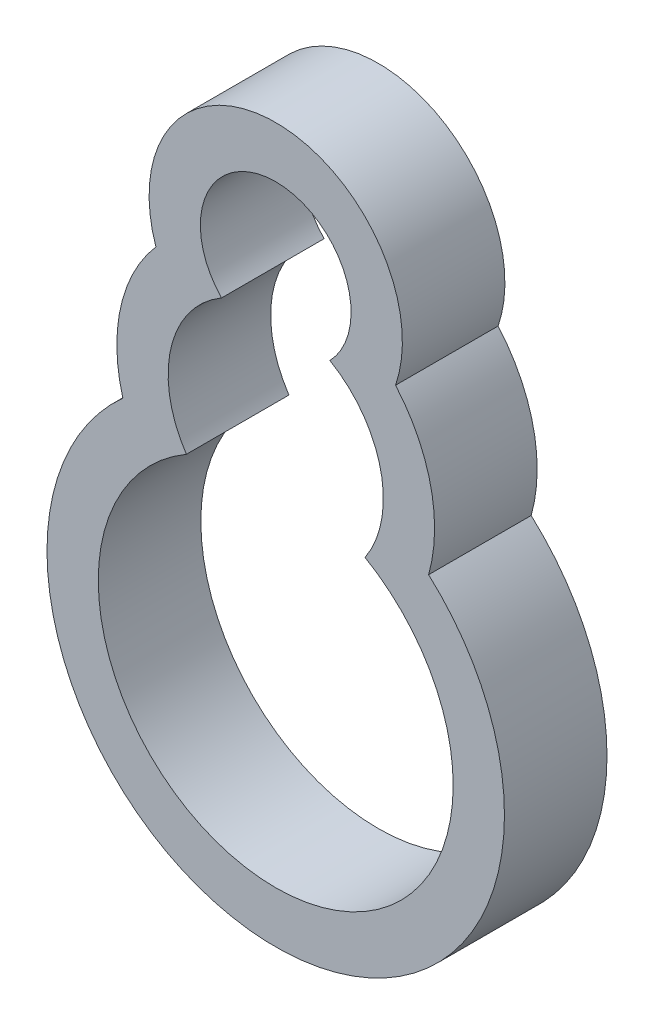
ISO-10303-21;
HEADER;
FILE_DESCRIPTION(('STEP AP214'),'2;1');
FILE_NAME('part.step','',(''),(''),'','','');
FILE_SCHEMA(('AUTOMOTIVE_DESIGN { 1 0 10303 214 1 1 1 1 }'));
ENDSEC;
DATA;
#1=APPLICATION_CONTEXT('core data for automotive mechanical design processes');
#2=APPLICATION_PROTOCOL_DEFINITION('international standard','automotive_design',2000,#1);
#3=PRODUCT_CONTEXT('',#1,'mechanical');
#4=PRODUCT('Part','Part','',(#3));
#5=PRODUCT_RELATED_PRODUCT_CATEGORY('part','',(#4));
#6=PRODUCT_DEFINITION_FORMATION('','',#4);
#7=PRODUCT_DEFINITION_CONTEXT('part definition',#1,'design');
#8=PRODUCT_DEFINITION('design','',#6,#7);
#9=PRODUCT_DEFINITION_SHAPE('','',#8);
#10=(LENGTH_UNIT() NAMED_UNIT(*) SI_UNIT(.MILLI.,.METRE.));
#11=(NAMED_UNIT(*) PLANE_ANGLE_UNIT() SI_UNIT($,.RADIAN.));
#12=(NAMED_UNIT(*) SI_UNIT($,.STERADIAN.) SOLID_ANGLE_UNIT());
#13=UNCERTAINTY_MEASURE_WITH_UNIT(LENGTH_MEASURE(1.E-05),#10,'distance_accuracy_value','');
#14=(GEOMETRIC_REPRESENTATION_CONTEXT(3) GLOBAL_UNCERTAINTY_ASSIGNED_CONTEXT((#13)) GLOBAL_UNIT_ASSIGNED_CONTEXT((#10,
#11,#12)) REPRESENTATION_CONTEXT('',''));
#15=CARTESIAN_POINT('',(0.,0.,0.));
#16=DIRECTION('',(0.,0.,1.));
#17=DIRECTION('',(1.,0.,0.));
#18=AXIS2_PLACEMENT_3D('',#15,#16,#17);
#19=CARTESIAN_POINT('',(0.,16.1078463236737,10.));
#20=DIRECTION('',(0.,0.,1.));
#21=DIRECTION('',(1.,0.,0.));
#22=AXIS2_PLACEMENT_3D('',#19,#20,#21);
#23=PLANE('',#22);
#24=CARTESIAN_POINT('',(0.,9.02039394125725,10.));
#25=DIRECTION('',(0.,0.,1.));
#26=DIRECTION('',(1.,0.,0.));
#27=AXIS2_PLACEMENT_3D('',#24,#25,#26);
#28=CIRCLE('',#27,15.4931113194217);
#29=CARTESIAN_POINT('',(14.9093042116603,4.80742037379208,10.));
#30=VERTEX_POINT('',#29);
#31=CARTESIAN_POINT('',(11.6839303061137,19.1949834149349,10.));
#32=VERTEX_POINT('',#31);
#33=EDGE_CURVE('E138',#30,#32,#28,.T.);
#34=ORIENTED_EDGE('',*,*,#33,.T.);
#35=CARTESIAN_POINT('',(0.,23.1952987060901,10.));
#36=DIRECTION('',(0.,0.,1.));
#37=DIRECTION('',(1.,0.,0.));
#38=AXIS2_PLACEMENT_3D('',#35,#36,#37);
#39=CIRCLE('',#38,12.3497671972702);
#40=CARTESIAN_POINT('',(-11.6839303061137,19.1949834149349,10.));
#41=VERTEX_POINT('',#40);
#42=EDGE_CURVE('E141',#32,#41,#39,.T.);
#43=ORIENTED_EDGE('',*,*,#42,.T.);
#44=CARTESIAN_POINT('',(0.,9.02039394125725,10.));
#45=DIRECTION('',(0.,0.,1.));
#46=DIRECTION('',(1.,0.,0.));
#47=AXIS2_PLACEMENT_3D('',#44,#45,#46);
#48=CIRCLE('',#47,15.4931113194217);
#49=CARTESIAN_POINT('',(-14.9093042116603,4.80742037379207,10.));
#50=VERTEX_POINT('',#49);
#51=EDGE_CURVE('E144',#41,#50,#48,.T.);
#52=ORIENTED_EDGE('',*,*,#51,.T.);
#53=CARTESIAN_POINT('',(0.,-11.7817390253156,10.));
#54=DIRECTION('',(0.,0.,1.));
#55=DIRECTION('',(1.,0.,0.));
#56=AXIS2_PLACEMENT_3D('',#53,#54,#55);
#57=CIRCLE('',#56,22.3044291934323);
#58=EDGE_CURVE('E146',#50,#30,#57,.T.);
#59=ORIENTED_EDGE('',*,*,#58,.T.);
#60=EDGE_LOOP('',(#34,#43,#52,#59));
#61=FACE_BOUND('',#60,.T.);
#62=CARTESIAN_POINT('',(0.,23.1952987060901,10.));
#63=DIRECTION('',(0.,0.,1.));
#64=DIRECTION('',(1.,0.,0.));
#65=AXIS2_PLACEMENT_3D('',#62,#63,#64);
#66=CIRCLE('',#65,7.34976719727021);
#67=CARTESIAN_POINT('',(5.28358941293976,18.086212606841,10.));
#68=VERTEX_POINT('',#67);
#69=CARTESIAN_POINT('',(-5.28358941293976,18.086212606841,10.));
#70=VERTEX_POINT('',#69);
#71=EDGE_CURVE('E110',#68,#70,#66,.T.);
#72=ORIENTED_EDGE('',*,*,#71,.F.);
#73=CARTESIAN_POINT('',(0.,9.02039394125725,10.));
#74=DIRECTION('',(0.,0.,1.));
#75=DIRECTION('',(1.,0.,0.));
#76=AXIS2_PLACEMENT_3D('',#73,#74,#75);
#77=CIRCLE('',#76,10.4931113194217);
#78=CARTESIAN_POINT('',(8.71098313313225,3.17025223219915,10.));
#79=VERTEX_POINT('',#78);
#80=EDGE_CURVE('E102',#79,#68,#77,.T.);
#81=ORIENTED_EDGE('',*,*,#80,.F.);
#82=CARTESIAN_POINT('',(0.,-11.7817390253156,10.));
#83=DIRECTION('',(0.,0.,1.));
#84=DIRECTION('',(1.,0.,0.));
#85=AXIS2_PLACEMENT_3D('',#82,#83,#84);
#86=CIRCLE('',#85,17.3044291934323);
#87=CARTESIAN_POINT('',(-8.71098313313225,3.17025223219915,10.));
#88=VERTEX_POINT('',#87);
#89=EDGE_CURVE('E124',#88,#79,#86,.T.);
#90=ORIENTED_EDGE('',*,*,#89,.F.);
#91=CARTESIAN_POINT('',(0.,9.02039394125725,10.));
#92=DIRECTION('',(0.,0.,1.));
#93=DIRECTION('',(1.,0.,0.));
#94=AXIS2_PLACEMENT_3D('',#91,#92,#93);
#95=CIRCLE('',#94,10.4931113194217);
#96=EDGE_CURVE('E122',#70,#88,#95,.T.);
#97=ORIENTED_EDGE('',*,*,#96,.F.);
#98=EDGE_LOOP('',(#72,#81,#90,#97));
#99=FACE_BOUND('',#98,.T.);
#100=ADVANCED_FACE('F37',(#61,#99),#23,.T.);
#101=CARTESIAN_POINT('',(0.,16.1078463236737,0.));
#102=DIRECTION('',(0.,0.,1.));
#103=DIRECTION('',(1.,0.,0.));
#104=AXIS2_PLACEMENT_3D('',#101,#102,#103);
#105=PLANE('',#104);
#106=CARTESIAN_POINT('',(0.,9.02039394125725,0.));
#107=DIRECTION('',(0.,0.,1.));
#108=DIRECTION('',(1.,0.,0.));
#109=AXIS2_PLACEMENT_3D('',#106,#107,#108);
#110=CIRCLE('',#109,15.4931113194217);
#111=CARTESIAN_POINT('',(14.9093042116603,4.80742037379208,0.));
#112=VERTEX_POINT('',#111);
#113=CARTESIAN_POINT('',(11.6839303061137,19.1949834149349,0.));
#114=VERTEX_POINT('',#113);
#115=EDGE_CURVE('E118',#112,#114,#110,.T.);
#116=ORIENTED_EDGE('',*,*,#115,.F.);
#117=CARTESIAN_POINT('',(0.,-11.7817390253156,0.));
#118=DIRECTION('',(0.,0.,1.));
#119=DIRECTION('',(1.,0.,0.));
#120=AXIS2_PLACEMENT_3D('',#117,#118,#119);
#121=CIRCLE('',#120,22.3044291934323);
#122=CARTESIAN_POINT('',(-14.9093042116603,4.80742037379207,0.));
#123=VERTEX_POINT('',#122);
#124=EDGE_CURVE('E142',#123,#112,#121,.T.);
#125=ORIENTED_EDGE('',*,*,#124,.F.);
#126=CARTESIAN_POINT('',(0.,9.02039394125725,0.));
#127=DIRECTION('',(0.,0.,1.));
#128=DIRECTION('',(1.,0.,0.));
#129=AXIS2_PLACEMENT_3D('',#126,#127,#128);
#130=CIRCLE('',#129,15.4931113194217);
#131=CARTESIAN_POINT('',(-11.6839303061137,19.1949834149349,0.));
#132=VERTEX_POINT('',#131);
#133=EDGE_CURVE('E153',#132,#123,#130,.T.);
#134=ORIENTED_EDGE('',*,*,#133,.F.);
#135=CARTESIAN_POINT('',(0.,23.1952987060901,0.));
#136=DIRECTION('',(0.,0.,1.));
#137=DIRECTION('',(1.,0.,0.));
#138=AXIS2_PLACEMENT_3D('',#135,#136,#137);
#139=CIRCLE('',#138,12.3497671972702);
#140=EDGE_CURVE('E151',#114,#132,#139,.T.);
#141=ORIENTED_EDGE('',*,*,#140,.F.);
#142=EDGE_LOOP('',(#116,#125,#134,#141));
#143=FACE_BOUND('',#142,.T.);
#144=CARTESIAN_POINT('',(0.,9.02039394125725,0.));
#145=DIRECTION('',(0.,0.,1.));
#146=DIRECTION('',(1.,0.,0.));
#147=AXIS2_PLACEMENT_3D('',#144,#145,#146);
#148=CIRCLE('',#147,10.4931113194217);
#149=CARTESIAN_POINT('',(8.71098313313225,3.17025223219915,0.));
#150=VERTEX_POINT('',#149);
#151=CARTESIAN_POINT('',(5.28358941293976,18.086212606841,0.));
#152=VERTEX_POINT('',#151);
#153=EDGE_CURVE('E60',#150,#152,#148,.T.);
#154=ORIENTED_EDGE('',*,*,#153,.T.);
#155=CARTESIAN_POINT('',(0.,23.1952987060901,0.));
#156=DIRECTION('',(0.,0.,1.));
#157=DIRECTION('',(1.,0.,0.));
#158=AXIS2_PLACEMENT_3D('',#155,#156,#157);
#159=CIRCLE('',#158,7.34976719727021);
#160=CARTESIAN_POINT('',(-5.28358941293976,18.086212606841,0.));
#161=VERTEX_POINT('',#160);
#162=EDGE_CURVE('E117',#152,#161,#159,.T.);
#163=ORIENTED_EDGE('',*,*,#162,.T.);
#164=CARTESIAN_POINT('',(0.,9.02039394125725,0.));
#165=DIRECTION('',(0.,0.,1.));
#166=DIRECTION('',(1.,0.,0.));
#167=AXIS2_PLACEMENT_3D('',#164,#165,#166);
#168=CIRCLE('',#167,10.4931113194217);
#169=CARTESIAN_POINT('',(-8.71098313313225,3.17025223219915,0.));
#170=VERTEX_POINT('',#169);
#171=EDGE_CURVE('E130',#161,#170,#168,.T.);
#172=ORIENTED_EDGE('',*,*,#171,.T.);
#173=CARTESIAN_POINT('',(0.,-11.7817390253156,0.));
#174=DIRECTION('',(0.,0.,1.));
#175=DIRECTION('',(1.,0.,0.));
#176=AXIS2_PLACEMENT_3D('',#173,#174,#175);
#177=CIRCLE('',#176,17.3044291934323);
#178=EDGE_CURVE('E111',#170,#150,#177,.T.);
#179=ORIENTED_EDGE('',*,*,#178,.T.);
#180=EDGE_LOOP('',(#154,#163,#172,#179));
#181=FACE_BOUND('',#180,.T.);
#182=ADVANCED_FACE('F171',(#143,#181),#105,.F.);
#183=CARTESIAN_POINT('',(0.,9.02039394125725,10.));
#184=DIRECTION('',(0.,0.,-1.));
#185=DIRECTION('',(-1.,0.,0.));
#186=AXIS2_PLACEMENT_3D('',#183,#184,#185);
#187=CYLINDRICAL_SURFACE('',#186,15.4931113194217);
#188=ORIENTED_EDGE('',*,*,#115,.T.);
#189=DIRECTION('',(0.,0.,-1.));
#190=VECTOR('',#189,1.);
#191=CARTESIAN_POINT('',(11.6839303061137,19.1949834149349,10.));
#192=LINE('',#191,#190);
#193=EDGE_CURVE('E11',#32,#114,#192,.T.);
#194=ORIENTED_EDGE('',*,*,#193,.F.);
#195=ORIENTED_EDGE('',*,*,#33,.F.);
#196=DIRECTION('',(0.,0.,-1.));
#197=VECTOR('',#196,1.);
#198=CARTESIAN_POINT('',(14.9093042116603,4.80742037379208,10.));
#199=LINE('',#198,#197);
#200=EDGE_CURVE('E148',#30,#112,#199,.T.);
#201=ORIENTED_EDGE('',*,*,#200,.T.);
#202=EDGE_LOOP('',(#188,#194,#195,#201));
#203=FACE_BOUND('',#202,.T.);
#204=ADVANCED_FACE('F39',(#203),#187,.T.);
#205=CARTESIAN_POINT('',(0.,23.1952987060901,10.));
#206=DIRECTION('',(0.,0.,-1.));
#207=DIRECTION('',(-1.,0.,0.));
#208=AXIS2_PLACEMENT_3D('',#205,#206,#207);
#209=CYLINDRICAL_SURFACE('',#208,12.3497671972702);
#210=ORIENTED_EDGE('',*,*,#140,.T.);
#211=DIRECTION('',(0.,0.,-1.));
#212=VECTOR('',#211,1.);
#213=CARTESIAN_POINT('',(-11.6839303061137,19.1949834149349,10.));
#214=LINE('',#213,#212);
#215=EDGE_CURVE('E45',#41,#132,#214,.T.);
#216=ORIENTED_EDGE('',*,*,#215,.F.);
#217=ORIENTED_EDGE('',*,*,#42,.F.);
#218=ORIENTED_EDGE('',*,*,#193,.T.);
#219=EDGE_LOOP('',(#210,#216,#217,#218));
#220=FACE_BOUND('',#219,.T.);
#221=ADVANCED_FACE('F181',(#220),#209,.T.);
#222=CARTESIAN_POINT('',(0.,9.02039394125725,10.));
#223=DIRECTION('',(0.,0.,-1.));
#224=DIRECTION('',(-1.,0.,0.));
#225=AXIS2_PLACEMENT_3D('',#222,#223,#224);
#226=CYLINDRICAL_SURFACE('',#225,15.4931113194217);
#227=ORIENTED_EDGE('',*,*,#133,.T.);
#228=DIRECTION('',(0.,0.,-1.));
#229=VECTOR('',#228,1.);
#230=CARTESIAN_POINT('',(-14.9093042116603,4.80742037379207,10.));
#231=LINE('',#230,#229);
#232=EDGE_CURVE('E158',#50,#123,#231,.T.);
#233=ORIENTED_EDGE('',*,*,#232,.F.);
#234=ORIENTED_EDGE('',*,*,#51,.F.);
#235=ORIENTED_EDGE('',*,*,#215,.T.);
#236=EDGE_LOOP('',(#227,#233,#234,#235));
#237=FACE_BOUND('',#236,.T.);
#238=ADVANCED_FACE('F165',(#237),#226,.T.);
#239=CARTESIAN_POINT('',(0.,-11.7817390253156,10.));
#240=DIRECTION('',(0.,0.,-1.));
#241=DIRECTION('',(-1.,0.,0.));
#242=AXIS2_PLACEMENT_3D('',#239,#240,#241);
#243=CYLINDRICAL_SURFACE('',#242,22.3044291934323);
#244=ORIENTED_EDGE('',*,*,#124,.T.);
#245=ORIENTED_EDGE('',*,*,#200,.F.);
#246=ORIENTED_EDGE('',*,*,#58,.F.);
#247=ORIENTED_EDGE('',*,*,#232,.T.);
#248=EDGE_LOOP('',(#244,#245,#246,#247));
#249=FACE_BOUND('',#248,.T.);
#250=ADVANCED_FACE('F175',(#249),#243,.T.);
#251=CARTESIAN_POINT('',(0.,9.02039394125725,10.));
#252=DIRECTION('',(0.,0.,-1.));
#253=DIRECTION('',(-1.,0.,0.));
#254=AXIS2_PLACEMENT_3D('',#251,#252,#253);
#255=CYLINDRICAL_SURFACE('',#254,10.4931113194217);
#256=ORIENTED_EDGE('',*,*,#153,.F.);
#257=DIRECTION('',(0.,0.,-1.));
#258=VECTOR('',#257,1.);
#259=CARTESIAN_POINT('',(8.71098313313225,3.17025223219915,10.));
#260=LINE('',#259,#258);
#261=EDGE_CURVE('E106',#79,#150,#260,.T.);
#262=ORIENTED_EDGE('',*,*,#261,.F.);
#263=ORIENTED_EDGE('',*,*,#80,.T.);
#264=DIRECTION('',(0.,0.,-1.));
#265=VECTOR('',#264,1.);
#266=CARTESIAN_POINT('',(5.28358941293976,18.086212606841,10.));
#267=LINE('',#266,#265);
#268=EDGE_CURVE('E105',#68,#152,#267,.T.);
#269=ORIENTED_EDGE('',*,*,#268,.T.);
#270=EDGE_LOOP('',(#256,#262,#263,#269));
#271=FACE_BOUND('',#270,.T.);
#272=ADVANCED_FACE('F104',(#271),#255,.F.);
#273=CARTESIAN_POINT('',(0.,23.1952987060901,10.));
#274=DIRECTION('',(0.,0.,-1.));
#275=DIRECTION('',(-1.,0.,0.));
#276=AXIS2_PLACEMENT_3D('',#273,#274,#275);
#277=CYLINDRICAL_SURFACE('',#276,7.34976719727021);
#278=ORIENTED_EDGE('',*,*,#162,.F.);
#279=ORIENTED_EDGE('',*,*,#268,.F.);
#280=ORIENTED_EDGE('',*,*,#71,.T.);
#281=DIRECTION('',(0.,0.,-1.));
#282=VECTOR('',#281,1.);
#283=CARTESIAN_POINT('',(-5.28358941293976,18.086212606841,10.));
#284=LINE('',#283,#282);
#285=EDGE_CURVE('E119',#70,#161,#284,.T.);
#286=ORIENTED_EDGE('',*,*,#285,.T.);
#287=EDGE_LOOP('',(#278,#279,#280,#286));
#288=FACE_BOUND('',#287,.T.);
#289=ADVANCED_FACE('F114',(#288),#277,.F.);
#290=CARTESIAN_POINT('',(0.,9.02039394125725,10.));
#291=DIRECTION('',(0.,0.,-1.));
#292=DIRECTION('',(-1.,0.,0.));
#293=AXIS2_PLACEMENT_3D('',#290,#291,#292);
#294=CYLINDRICAL_SURFACE('',#293,10.4931113194217);
#295=ORIENTED_EDGE('',*,*,#171,.F.);
#296=ORIENTED_EDGE('',*,*,#285,.F.);
#297=ORIENTED_EDGE('',*,*,#96,.T.);
#298=DIRECTION('',(0.,0.,-1.));
#299=VECTOR('',#298,1.);
#300=CARTESIAN_POINT('',(-8.71098313313225,3.17025223219915,10.));
#301=LINE('',#300,#299);
#302=EDGE_CURVE('E52',#88,#170,#301,.T.);
#303=ORIENTED_EDGE('',*,*,#302,.T.);
#304=EDGE_LOOP('',(#295,#296,#297,#303));
#305=FACE_BOUND('',#304,.T.);
#306=ADVANCED_FACE('F204',(#305),#294,.F.);
#307=CARTESIAN_POINT('',(0.,-11.7817390253156,10.));
#308=DIRECTION('',(0.,0.,-1.));
#309=DIRECTION('',(-1.,0.,0.));
#310=AXIS2_PLACEMENT_3D('',#307,#308,#309);
#311=CYLINDRICAL_SURFACE('',#310,17.3044291934323);
#312=ORIENTED_EDGE('',*,*,#178,.F.);
#313=ORIENTED_EDGE('',*,*,#302,.F.);
#314=ORIENTED_EDGE('',*,*,#89,.T.);
#315=ORIENTED_EDGE('',*,*,#261,.T.);
#316=EDGE_LOOP('',(#312,#313,#314,#315));
#317=FACE_BOUND('',#316,.T.);
#318=ADVANCED_FACE('F208',(#317),#311,.F.);
#319=CLOSED_SHELL('',(#100,#182,#204,#221,#238,#250,#272,#289,#306,#318));
#320=MANIFOLD_SOLID_BREP('B2',#319);
#321=ADVANCED_BREP_SHAPE_REPRESENTATION('',(#18,#320),#14);
#322=SHAPE_DEFINITION_REPRESENTATION(#9,#321);
ENDSEC;
END-ISO-10303-21;
